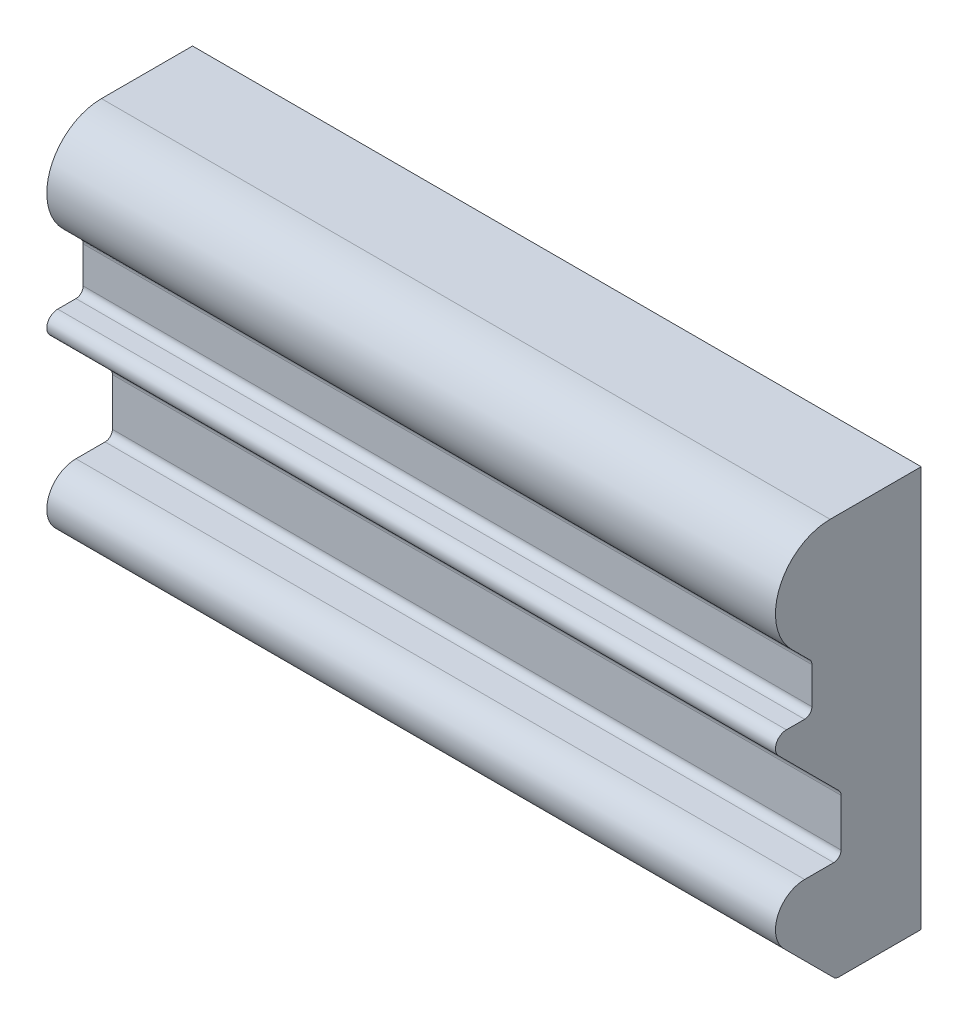
ISO-10303-21;
HEADER;
FILE_DESCRIPTION(('STEP AP214'),'2;1');
FILE_NAME('part.step','',(''),(''),'','','');
FILE_SCHEMA(('AUTOMOTIVE_DESIGN { 1 0 10303 214 1 1 1 1 }'));
ENDSEC;
DATA;
#1=APPLICATION_CONTEXT('core data for automotive mechanical design processes');
#2=APPLICATION_PROTOCOL_DEFINITION('international standard','automotive_design',2000,#1);
#3=PRODUCT_CONTEXT('',#1,'mechanical');
#4=PRODUCT('Part','Part','',(#3));
#5=PRODUCT_RELATED_PRODUCT_CATEGORY('part','',(#4));
#6=PRODUCT_DEFINITION_FORMATION('','',#4);
#7=PRODUCT_DEFINITION_CONTEXT('part definition',#1,'design');
#8=PRODUCT_DEFINITION('design','',#6,#7);
#9=PRODUCT_DEFINITION_SHAPE('','',#8);
#10=(LENGTH_UNIT() NAMED_UNIT(*) SI_UNIT(.MILLI.,.METRE.));
#11=(NAMED_UNIT(*) PLANE_ANGLE_UNIT() SI_UNIT($,.RADIAN.));
#12=(NAMED_UNIT(*) SI_UNIT($,.STERADIAN.) SOLID_ANGLE_UNIT());
#13=UNCERTAINTY_MEASURE_WITH_UNIT(LENGTH_MEASURE(1.E-05),#10,'distance_accuracy_value','');
#14=(GEOMETRIC_REPRESENTATION_CONTEXT(3) GLOBAL_UNCERTAINTY_ASSIGNED_CONTEXT((#13)) GLOBAL_UNIT_ASSIGNED_CONTEXT((#10,
#11,#12)) REPRESENTATION_CONTEXT('',''));
#15=CARTESIAN_POINT('',(0.,0.,0.));
#16=DIRECTION('',(0.,0.,1.));
#17=DIRECTION('',(1.,0.,0.));
#18=AXIS2_PLACEMENT_3D('',#15,#16,#17);
#19=CARTESIAN_POINT('',(200.,67.9583694396574,32.));
#20=DIRECTION('',(-1.,0.,0.));
#21=DIRECTION('',(0.,0.,1.));
#22=AXIS2_PLACEMENT_3D('',#19,#20,#21);
#23=CYLINDRICAL_SURFACE('',#22,2.);
#24=CARTESIAN_POINT('',(0.,67.9583694396574,32.));
#25=DIRECTION('',(-1.,0.,0.));
#26=DIRECTION('',(0.,0.,1.));
#27=AXIS2_PLACEMENT_3D('',#24,#25,#26);
#28=CIRCLE('',#27,2.);
#29=CARTESIAN_POINT('',(0.,67.9583694396574,30.));
#30=VERTEX_POINT('',#29);
#31=CARTESIAN_POINT('',(0.,65.9583694396574,32.));
#32=VERTEX_POINT('',#31);
#33=EDGE_CURVE('E189',#30,#32,#28,.T.);
#34=ORIENTED_EDGE('',*,*,#33,.T.);
#35=DIRECTION('',(-1.,0.,0.));
#36=VECTOR('',#35,1.);
#37=CARTESIAN_POINT('',(200.,65.9583694396574,32.));
#38=LINE('',#37,#36);
#39=CARTESIAN_POINT('',(200.,65.9583694396574,32.));
#40=VERTEX_POINT('',#39);
#41=EDGE_CURVE('E11',#40,#32,#38,.T.);
#42=ORIENTED_EDGE('',*,*,#41,.F.);
#43=CARTESIAN_POINT('',(200.,67.9583694396574,32.));
#44=DIRECTION('',(-1.,0.,0.));
#45=DIRECTION('',(0.,0.,1.));
#46=AXIS2_PLACEMENT_3D('',#43,#44,#45);
#47=CIRCLE('',#46,2.);
#48=CARTESIAN_POINT('',(200.,67.9583694396574,30.));
#49=VERTEX_POINT('',#48);
#50=EDGE_CURVE('E223',#49,#40,#47,.T.);
#51=ORIENTED_EDGE('',*,*,#50,.F.);
#52=DIRECTION('',(-1.,0.,0.));
#53=VECTOR('',#52,1.);
#54=CARTESIAN_POINT('',(200.,67.9583694396574,30.));
#55=LINE('',#54,#53);
#56=EDGE_CURVE('E185',#49,#30,#55,.T.);
#57=ORIENTED_EDGE('',*,*,#56,.T.);
#58=EDGE_LOOP('',(#34,#42,#51,#57));
#59=FACE_BOUND('',#58,.T.);
#60=ADVANCED_FACE('F33',(#59),#23,.F.);
#61=CARTESIAN_POINT('',(200.,65.9583694396574,37.));
#62=DIRECTION('',(0.,-1.,0.));
#63=DIRECTION('',(0.,0.,-1.));
#64=AXIS2_PLACEMENT_3D('',#61,#62,#63);
#65=PLANE('',#64);
#66=DIRECTION('',(0.,0.,1.));
#67=VECTOR('',#66,1.);
#68=CARTESIAN_POINT('',(0.,65.9583694396574,37.));
#69=LINE('',#68,#67);
#70=CARTESIAN_POINT('',(0.,65.9583694396574,37.));
#71=VERTEX_POINT('',#70);
#72=EDGE_CURVE('E192',#32,#71,#69,.T.);
#73=ORIENTED_EDGE('',*,*,#72,.T.);
#74=DIRECTION('',(-1.,0.,0.));
#75=VECTOR('',#74,1.);
#76=CARTESIAN_POINT('',(200.,65.9583694396574,37.));
#77=LINE('',#76,#75);
#78=CARTESIAN_POINT('',(200.,65.9583694396574,37.));
#79=VERTEX_POINT('',#78);
#80=EDGE_CURVE('E41',#79,#71,#77,.T.);
#81=ORIENTED_EDGE('',*,*,#80,.F.);
#82=DIRECTION('',(0.,0.,1.));
#83=VECTOR('',#82,1.);
#84=CARTESIAN_POINT('',(200.,65.9583694396574,37.));
#85=LINE('',#84,#83);
#86=EDGE_CURVE('E122',#40,#79,#85,.T.);
#87=ORIENTED_EDGE('',*,*,#86,.F.);
#88=ORIENTED_EDGE('',*,*,#41,.T.);
#89=EDGE_LOOP('',(#73,#81,#87,#88));
#90=FACE_BOUND('',#89,.T.);
#91=ADVANCED_FACE('F331',(#90),#65,.F.);
#92=CARTESIAN_POINT('',(200.,62.9583694396574,37.));
#93=DIRECTION('',(-1.,0.,0.));
#94=DIRECTION('',(0.,0.,1.));
#95=AXIS2_PLACEMENT_3D('',#92,#93,#94);
#96=CYLINDRICAL_SURFACE('',#95,3.);
#97=CARTESIAN_POINT('',(0.,62.9583694396574,37.));
#98=DIRECTION('',(1.,0.,0.));
#99=DIRECTION('',(0.,0.,-1.));
#100=AXIS2_PLACEMENT_3D('',#97,#98,#99);
#101=CIRCLE('',#100,3.);
#102=CARTESIAN_POINT('',(0.,60.8370490960978,39.1213203435597));
#103=VERTEX_POINT('',#102);
#104=EDGE_CURVE('E194',#71,#103,#101,.T.);
#105=ORIENTED_EDGE('',*,*,#104,.T.);
#106=DIRECTION('',(-1.,0.,0.));
#107=VECTOR('',#106,1.);
#108=CARTESIAN_POINT('',(200.,60.8370490960978,39.1213203435597));
#109=LINE('',#108,#107);
#110=CARTESIAN_POINT('',(200.,60.8370490960978,39.1213203435597));
#111=VERTEX_POINT('',#110);
#112=EDGE_CURVE('E260',#111,#103,#109,.T.);
#113=ORIENTED_EDGE('',*,*,#112,.F.);
#114=CARTESIAN_POINT('',(200.,62.9583694396574,37.));
#115=DIRECTION('',(1.,0.,0.));
#116=DIRECTION('',(0.,0.,-1.));
#117=AXIS2_PLACEMENT_3D('',#114,#115,#116);
#118=CIRCLE('',#117,3.);
#119=EDGE_CURVE('E268',#79,#111,#118,.T.);
#120=ORIENTED_EDGE('',*,*,#119,.F.);
#121=ORIENTED_EDGE('',*,*,#80,.T.);
#122=EDGE_LOOP('',(#105,#113,#120,#121));
#123=FACE_BOUND('',#122,.T.);
#124=ADVANCED_FACE('F266',(#123),#96,.T.);
#125=CARTESIAN_POINT('',(200.,60.8370490960978,39.1213203435597));
#126=DIRECTION('',(0.,0.707106781186544,-0.707106781186551));
#127=DIRECTION('',(0.,0.707106781186551,0.707106781186544));
#128=AXIS2_PLACEMENT_3D('',#125,#126,#127);
#129=PLANE('',#128);
#130=DIRECTION('',(0.,-0.707106781186551,-0.707106781186544));
#131=VECTOR('',#130,1.);
#132=CARTESIAN_POINT('',(0.,60.8370490960978,39.1213203435597));
#133=LINE('',#132,#131);
#134=CARTESIAN_POINT('',(0.,44.3015151901646,22.5857864376266));
#135=VERTEX_POINT('',#134);
#136=EDGE_CURVE('E196',#103,#135,#133,.T.);
#137=ORIENTED_EDGE('',*,*,#136,.T.);
#138=DIRECTION('',(-1.,0.,0.));
#139=VECTOR('',#138,1.);
#140=CARTESIAN_POINT('',(200.,44.3015151901646,22.5857864376266));
#141=LINE('',#140,#139);
#142=CARTESIAN_POINT('',(200.,44.3015151901646,22.5857864376266));
#143=VERTEX_POINT('',#142);
#144=EDGE_CURVE('E257',#143,#135,#141,.T.);
#145=ORIENTED_EDGE('',*,*,#144,.F.);
#146=DIRECTION('',(0.,-0.707106781186551,-0.707106781186544));
#147=VECTOR('',#146,1.);
#148=CARTESIAN_POINT('',(200.,60.8370490960978,39.1213203435597));
#149=LINE('',#148,#147);
#150=EDGE_CURVE('E286',#111,#143,#149,.T.);
#151=ORIENTED_EDGE('',*,*,#150,.F.);
#152=ORIENTED_EDGE('',*,*,#112,.T.);
#153=EDGE_LOOP('',(#137,#145,#151,#152));
#154=FACE_BOUND('',#153,.T.);
#155=ADVANCED_FACE('F277',(#154),#129,.F.);
#156=CARTESIAN_POINT('',(200.,42.8873016277915,23.9999999999997));
#157=DIRECTION('',(-1.,0.,0.));
#158=DIRECTION('',(0.,0.,1.));
#159=AXIS2_PLACEMENT_3D('',#156,#157,#158);
#160=CYLINDRICAL_SURFACE('',#159,1.99999999999998);
#161=CARTESIAN_POINT('',(0.,42.8873016277915,23.9999999999997));
#162=DIRECTION('',(-1.,0.,0.));
#163=DIRECTION('',(0.,0.,1.));
#164=AXIS2_PLACEMENT_3D('',#161,#162,#163);
#165=CIRCLE('',#164,1.99999999999998);
#166=CARTESIAN_POINT('',(0.,42.8873016277915,21.9999999999997));
#167=VERTEX_POINT('',#166);
#168=EDGE_CURVE('E198',#135,#167,#165,.T.);
#169=ORIENTED_EDGE('',*,*,#168,.T.);
#170=DIRECTION('',(-1.,0.,0.));
#171=VECTOR('',#170,1.);
#172=CARTESIAN_POINT('',(200.,42.8873016277915,21.9999999999997));
#173=LINE('',#172,#171);
#174=CARTESIAN_POINT('',(200.,42.8873016277915,21.9999999999997));
#175=VERTEX_POINT('',#174);
#176=EDGE_CURVE('E254',#175,#167,#173,.T.);
#177=ORIENTED_EDGE('',*,*,#176,.F.);
#178=CARTESIAN_POINT('',(200.,42.8873016277915,23.9999999999997));
#179=DIRECTION('',(-1.,0.,0.));
#180=DIRECTION('',(0.,0.,1.));
#181=AXIS2_PLACEMENT_3D('',#178,#179,#180);
#182=CIRCLE('',#181,1.99999999999998);
#183=EDGE_CURVE('E283',#143,#175,#182,.T.);
#184=ORIENTED_EDGE('',*,*,#183,.F.);
#185=ORIENTED_EDGE('',*,*,#144,.T.);
#186=EDGE_LOOP('',(#169,#177,#184,#185));
#187=FACE_BOUND('',#186,.T.);
#188=ADVANCED_FACE('F281',(#187),#160,.F.);
#189=CARTESIAN_POINT('',(200.,29.8873016277915,21.9999999999997));
#190=DIRECTION('',(0.,0.,-1.));
#191=DIRECTION('',(0.,1.,0.));
#192=AXIS2_PLACEMENT_3D('',#189,#190,#191);
#193=PLANE('',#192);
#194=DIRECTION('',(0.,-1.,0.));
#195=VECTOR('',#194,1.);
#196=CARTESIAN_POINT('',(0.,29.8873016277915,21.9999999999997));
#197=LINE('',#196,#195);
#198=CARTESIAN_POINT('',(0.,29.8873016277915,21.9999999999997));
#199=VERTEX_POINT('',#198);
#200=EDGE_CURVE('E200',#167,#199,#197,.T.);
#201=ORIENTED_EDGE('',*,*,#200,.T.);
#202=DIRECTION('',(-1.,0.,0.));
#203=VECTOR('',#202,1.);
#204=CARTESIAN_POINT('',(200.,29.8873016277915,21.9999999999997));
#205=LINE('',#204,#203);
#206=CARTESIAN_POINT('',(200.,29.8873016277915,21.9999999999997));
#207=VERTEX_POINT('',#206);
#208=EDGE_CURVE('E251',#207,#199,#205,.T.);
#209=ORIENTED_EDGE('',*,*,#208,.F.);
#210=DIRECTION('',(0.,-1.,0.));
#211=VECTOR('',#210,1.);
#212=CARTESIAN_POINT('',(200.,29.8873016277915,21.9999999999997));
#213=LINE('',#212,#211);
#214=EDGE_CURVE('E285',#175,#207,#213,.T.);
#215=ORIENTED_EDGE('',*,*,#214,.F.);
#216=ORIENTED_EDGE('',*,*,#176,.T.);
#217=EDGE_LOOP('',(#201,#209,#215,#216));
#218=FACE_BOUND('',#217,.T.);
#219=ADVANCED_FACE('F344',(#218),#193,.F.);
#220=CARTESIAN_POINT('',(200.,29.8873016277915,23.9999999999997));
#221=DIRECTION('',(-1.,0.,0.));
#222=DIRECTION('',(0.,0.,1.));
#223=AXIS2_PLACEMENT_3D('',#220,#221,#222);
#224=CYLINDRICAL_SURFACE('',#223,2.);
#225=CARTESIAN_POINT('',(0.,29.8873016277915,23.9999999999997));
#226=DIRECTION('',(-1.,0.,0.));
#227=DIRECTION('',(0.,0.,1.));
#228=AXIS2_PLACEMENT_3D('',#225,#226,#227);
#229=CIRCLE('',#228,2.);
#230=CARTESIAN_POINT('',(0.,27.8873016277915,23.9999999999997));
#231=VERTEX_POINT('',#230);
#232=EDGE_CURVE('E202',#199,#231,#229,.T.);
#233=ORIENTED_EDGE('',*,*,#232,.T.);
#234=DIRECTION('',(-1.,0.,0.));
#235=VECTOR('',#234,1.);
#236=CARTESIAN_POINT('',(200.,27.8873016277915,23.9999999999997));
#237=LINE('',#236,#235);
#238=CARTESIAN_POINT('',(200.,27.8873016277915,23.9999999999997));
#239=VERTEX_POINT('',#238);
#240=EDGE_CURVE('E248',#239,#231,#237,.T.);
#241=ORIENTED_EDGE('',*,*,#240,.F.);
#242=CARTESIAN_POINT('',(200.,29.8873016277915,23.9999999999997));
#243=DIRECTION('',(-1.,0.,0.));
#244=DIRECTION('',(0.,0.,1.));
#245=AXIS2_PLACEMENT_3D('',#242,#243,#244);
#246=CIRCLE('',#245,2.);
#247=EDGE_CURVE('E288',#207,#239,#246,.T.);
#248=ORIENTED_EDGE('',*,*,#247,.F.);
#249=ORIENTED_EDGE('',*,*,#208,.T.);
#250=EDGE_LOOP('',(#233,#241,#248,#249));
#251=FACE_BOUND('',#250,.T.);
#252=ADVANCED_FACE('F347',(#251),#224,.F.);
#253=CARTESIAN_POINT('',(200.,27.8873016277915,32.));
#254=DIRECTION('',(0.,-1.,0.));
#255=DIRECTION('',(0.,0.,-1.));
#256=AXIS2_PLACEMENT_3D('',#253,#254,#255);
#257=PLANE('',#256);
#258=DIRECTION('',(0.,0.,1.));
#259=VECTOR('',#258,1.);
#260=CARTESIAN_POINT('',(0.,27.8873016277915,32.));
#261=LINE('',#260,#259);
#262=CARTESIAN_POINT('',(0.,27.8873016277915,32.));
#263=VERTEX_POINT('',#262);
#264=EDGE_CURVE('E204',#231,#263,#261,.T.);
#265=ORIENTED_EDGE('',*,*,#264,.T.);
#266=DIRECTION('',(-1.,0.,0.));
#267=VECTOR('',#266,1.);
#268=CARTESIAN_POINT('',(200.,27.8873016277915,32.));
#269=LINE('',#268,#267);
#270=CARTESIAN_POINT('',(200.,27.8873016277915,32.));
#271=VERTEX_POINT('',#270);
#272=EDGE_CURVE('E245',#271,#263,#269,.T.);
#273=ORIENTED_EDGE('',*,*,#272,.F.);
#274=DIRECTION('',(0.,0.,1.));
#275=VECTOR('',#274,1.);
#276=CARTESIAN_POINT('',(200.,27.8873016277915,32.));
#277=LINE('',#276,#275);
#278=EDGE_CURVE('E294',#239,#271,#277,.T.);
#279=ORIENTED_EDGE('',*,*,#278,.F.);
#280=ORIENTED_EDGE('',*,*,#240,.T.);
#281=EDGE_LOOP('',(#265,#273,#279,#280));
#282=FACE_BOUND('',#281,.T.);
#283=ADVANCED_FACE('F351',(#282),#257,.F.);
#284=CARTESIAN_POINT('',(200.,19.8873016277915,32.));
#285=DIRECTION('',(-1.,0.,0.));
#286=DIRECTION('',(0.,0.,1.));
#287=AXIS2_PLACEMENT_3D('',#284,#285,#286);
#288=CYLINDRICAL_SURFACE('',#287,8.);
#289=CARTESIAN_POINT('',(0.,19.8873016277915,32.));
#290=DIRECTION('',(1.,0.,0.));
#291=DIRECTION('',(0.,0.,-1.));
#292=AXIS2_PLACEMENT_3D('',#289,#290,#291);
#293=CIRCLE('',#292,8.);
#294=CARTESIAN_POINT('',(0.,14.2304473782989,37.6568542494922));
#295=VERTEX_POINT('',#294);
#296=EDGE_CURVE('E206',#263,#295,#293,.T.);
#297=ORIENTED_EDGE('',*,*,#296,.T.);
#298=DIRECTION('',(-1.,0.,0.));
#299=VECTOR('',#298,1.);
#300=CARTESIAN_POINT('',(200.,14.2304473782989,37.6568542494922));
#301=LINE('',#300,#299);
#302=CARTESIAN_POINT('',(200.,14.2304473782989,37.6568542494922));
#303=VERTEX_POINT('',#302);
#304=EDGE_CURVE('E242',#303,#295,#301,.T.);
#305=ORIENTED_EDGE('',*,*,#304,.F.);
#306=CARTESIAN_POINT('',(200.,19.8873016277915,32.));
#307=DIRECTION('',(1.,0.,0.));
#308=DIRECTION('',(0.,0.,-1.));
#309=AXIS2_PLACEMENT_3D('',#306,#307,#308);
#310=CIRCLE('',#309,8.);
#311=EDGE_CURVE('E296',#271,#303,#310,.T.);
#312=ORIENTED_EDGE('',*,*,#311,.F.);
#313=ORIENTED_EDGE('',*,*,#272,.T.);
#314=EDGE_LOOP('',(#297,#305,#312,#313));
#315=FACE_BOUND('',#314,.T.);
#316=ADVANCED_FACE('F355',(#315),#288,.T.);
#317=CARTESIAN_POINT('',(200.,14.2304473782989,37.6568542494922));
#318=DIRECTION('',(0.,0.707106781186568,-0.707106781186527));
#319=DIRECTION('',(0.,0.707106781186527,0.707106781186568));
#320=AXIS2_PLACEMENT_3D('',#317,#318,#319);
#321=PLANE('',#320);
#322=DIRECTION('',(0.,-0.707106781186527,-0.707106781186568));
#323=VECTOR('',#322,1.);
#324=CARTESIAN_POINT('',(0.,14.2304473782989,37.6568542494922));
#325=LINE('',#324,#323);
#326=CARTESIAN_POINT('',(0.,0.585786437626861,24.0121933088193));
#327=VERTEX_POINT('',#326);
#328=EDGE_CURVE('E208',#295,#327,#325,.T.);
#329=ORIENTED_EDGE('',*,*,#328,.T.);
#330=DIRECTION('',(-1.,0.,0.));
#331=VECTOR('',#330,1.);
#332=CARTESIAN_POINT('',(200.,0.585786437626861,24.0121933088193));
#333=LINE('',#332,#331);
#334=CARTESIAN_POINT('',(200.,0.585786437626861,24.0121933088193));
#335=VERTEX_POINT('',#334);
#336=EDGE_CURVE('E239',#335,#327,#333,.T.);
#337=ORIENTED_EDGE('',*,*,#336,.F.);
#338=DIRECTION('',(0.,-0.707106781186527,-0.707106781186568));
#339=VECTOR('',#338,1.);
#340=CARTESIAN_POINT('',(200.,14.2304473782989,37.6568542494922));
#341=LINE('',#340,#339);
#342=EDGE_CURVE('E298',#303,#335,#341,.T.);
#343=ORIENTED_EDGE('',*,*,#342,.F.);
#344=ORIENTED_EDGE('',*,*,#304,.T.);
#345=EDGE_LOOP('',(#329,#337,#343,#344));
#346=FACE_BOUND('',#345,.T.);
#347=ADVANCED_FACE('F359',(#346),#321,.F.);
#348=CARTESIAN_POINT('',(200.,2.,22.5979797464463));
#349=DIRECTION('',(-1.,0.,0.));
#350=DIRECTION('',(0.,0.,1.));
#351=AXIS2_PLACEMENT_3D('',#348,#349,#350);
#352=CYLINDRICAL_SURFACE('',#351,2.);
#353=CARTESIAN_POINT('',(0.,2.,22.5979797464463));
#354=DIRECTION('',(1.,0.,0.));
#355=DIRECTION('',(0.,0.,1.));
#356=AXIS2_PLACEMENT_3D('',#353,#354,#355);
#357=CIRCLE('',#356,2.);
#358=CARTESIAN_POINT('',(0.,0.,22.5979797464463));
#359=VERTEX_POINT('',#358);
#360=EDGE_CURVE('E210',#327,#359,#357,.T.);
#361=ORIENTED_EDGE('',*,*,#360,.T.);
#362=DIRECTION('',(-1.,0.,0.));
#363=VECTOR('',#362,1.);
#364=CARTESIAN_POINT('',(200.,0.,22.5979797464463));
#365=LINE('',#364,#363);
#366=CARTESIAN_POINT('',(200.,0.,22.5979797464463));
#367=VERTEX_POINT('',#366);
#368=EDGE_CURVE('E236',#367,#359,#365,.T.);
#369=ORIENTED_EDGE('',*,*,#368,.F.);
#370=CARTESIAN_POINT('',(200.,2.,22.5979797464463));
#371=DIRECTION('',(1.,0.,0.));
#372=DIRECTION('',(0.,0.,1.));
#373=AXIS2_PLACEMENT_3D('',#370,#371,#372);
#374=CIRCLE('',#373,2.);
#375=EDGE_CURVE('E300',#335,#367,#374,.T.);
#376=ORIENTED_EDGE('',*,*,#375,.F.);
#377=ORIENTED_EDGE('',*,*,#336,.T.);
#378=EDGE_LOOP('',(#361,#369,#376,#377));
#379=FACE_BOUND('',#378,.T.);
#380=ADVANCED_FACE('F363',(#379),#352,.T.);
#381=CARTESIAN_POINT('',(200.,0.,0.));
#382=DIRECTION('',(0.,1.,0.));
#383=DIRECTION('',(0.,0.,1.));
#384=AXIS2_PLACEMENT_3D('',#381,#382,#383);
#385=PLANE('',#384);
#386=DIRECTION('',(0.,0.,-1.));
#387=VECTOR('',#386,1.);
#388=CARTESIAN_POINT('',(0.,0.,0.));
#389=LINE('',#388,#387);
#390=CARTESIAN_POINT('',(0.,0.,0.));
#391=VERTEX_POINT('',#390);
#392=EDGE_CURVE('E212',#359,#391,#389,.T.);
#393=ORIENTED_EDGE('',*,*,#392,.T.);
#394=DIRECTION('',(-1.,0.,0.));
#395=VECTOR('',#394,1.);
#396=CARTESIAN_POINT('',(200.,0.,0.));
#397=LINE('',#396,#395);
#398=CARTESIAN_POINT('',(200.,0.,0.));
#399=VERTEX_POINT('',#398);
#400=EDGE_CURVE('E233',#399,#391,#397,.T.);
#401=ORIENTED_EDGE('',*,*,#400,.F.);
#402=DIRECTION('',(0.,0.,-1.));
#403=VECTOR('',#402,1.);
#404=CARTESIAN_POINT('',(200.,0.,0.));
#405=LINE('',#404,#403);
#406=EDGE_CURVE('E302',#367,#399,#405,.T.);
#407=ORIENTED_EDGE('',*,*,#406,.F.);
#408=ORIENTED_EDGE('',*,*,#368,.T.);
#409=EDGE_LOOP('',(#393,#401,#407,#408));
#410=FACE_BOUND('',#409,.T.);
#411=ADVANCED_FACE('F367',(#410),#385,.F.);
#412=CARTESIAN_POINT('',(200.,0.,0.));
#413=DIRECTION('',(0.,0.,1.));
#414=DIRECTION('',(0.,-1.,0.));
#415=AXIS2_PLACEMENT_3D('',#412,#413,#414);
#416=PLANE('',#415);
#417=DIRECTION('',(0.,1.,0.));
#418=VECTOR('',#417,1.);
#419=CARTESIAN_POINT('',(0.,0.,0.));
#420=LINE('',#419,#418);
#421=CARTESIAN_POINT('',(0.,110.,0.));
#422=VERTEX_POINT('',#421);
#423=EDGE_CURVE('E214',#391,#422,#420,.T.);
#424=ORIENTED_EDGE('',*,*,#423,.T.);
#425=DIRECTION('',(-1.,0.,0.));
#426=VECTOR('',#425,1.);
#427=CARTESIAN_POINT('',(200.,110.,0.));
#428=LINE('',#427,#426);
#429=CARTESIAN_POINT('',(200.,110.,0.));
#430=VERTEX_POINT('',#429);
#431=EDGE_CURVE('E230',#430,#422,#428,.T.);
#432=ORIENTED_EDGE('',*,*,#431,.F.);
#433=DIRECTION('',(0.,1.,0.));
#434=VECTOR('',#433,1.);
#435=CARTESIAN_POINT('',(200.,0.,0.));
#436=LINE('',#435,#434);
#437=EDGE_CURVE('E304',#399,#430,#436,.T.);
#438=ORIENTED_EDGE('',*,*,#437,.F.);
#439=ORIENTED_EDGE('',*,*,#400,.T.);
#440=EDGE_LOOP('',(#424,#432,#438,#439));
#441=FACE_BOUND('',#440,.T.);
#442=ADVANCED_FACE('F371',(#441),#416,.F.);
#443=CARTESIAN_POINT('',(200.,110.,0.));
#444=DIRECTION('',(0.,-1.,0.));
#445=DIRECTION('',(0.,0.,-1.));
#446=AXIS2_PLACEMENT_3D('',#443,#444,#445);
#447=PLANE('',#446);
#448=DIRECTION('',(0.,0.,1.));
#449=VECTOR('',#448,1.);
#450=CARTESIAN_POINT('',(0.,110.,0.));
#451=LINE('',#450,#449);
#452=CARTESIAN_POINT('',(0.,110.,25.));
#453=VERTEX_POINT('',#452);
#454=EDGE_CURVE('E216',#422,#453,#451,.T.);
#455=ORIENTED_EDGE('',*,*,#454,.T.);
#456=DIRECTION('',(-1.,0.,0.));
#457=VECTOR('',#456,1.);
#458=CARTESIAN_POINT('',(200.,110.,25.));
#459=LINE('',#458,#457);
#460=CARTESIAN_POINT('',(200.,110.,25.));
#461=VERTEX_POINT('',#460);
#462=EDGE_CURVE('E227',#461,#453,#459,.T.);
#463=ORIENTED_EDGE('',*,*,#462,.F.);
#464=DIRECTION('',(0.,0.,1.));
#465=VECTOR('',#464,1.);
#466=CARTESIAN_POINT('',(200.,110.,0.));
#467=LINE('',#466,#465);
#468=EDGE_CURVE('E306',#430,#461,#467,.T.);
#469=ORIENTED_EDGE('',*,*,#468,.F.);
#470=ORIENTED_EDGE('',*,*,#431,.T.);
#471=EDGE_LOOP('',(#455,#463,#469,#470));
#472=FACE_BOUND('',#471,.T.);
#473=ADVANCED_FACE('F312',(#472),#447,.F.);
#474=CARTESIAN_POINT('',(200.,95.,25.));
#475=DIRECTION('',(-1.,0.,0.));
#476=DIRECTION('',(0.,0.,1.));
#477=AXIS2_PLACEMENT_3D('',#474,#475,#476);
#478=CYLINDRICAL_SURFACE('',#477,15.);
#479=CARTESIAN_POINT('',(0.,95.,25.));
#480=DIRECTION('',(1.,0.,0.));
#481=DIRECTION('',(0.,0.,-1.));
#482=AXIS2_PLACEMENT_3D('',#479,#480,#481);
#483=CIRCLE('',#482,15.);
#484=CARTESIAN_POINT('',(0.,84.3933982822017,35.6066017177982));
#485=VERTEX_POINT('',#484);
#486=EDGE_CURVE('E218',#453,#485,#483,.T.);
#487=ORIENTED_EDGE('',*,*,#486,.T.);
#488=DIRECTION('',(-1.,0.,0.));
#489=VECTOR('',#488,1.);
#490=CARTESIAN_POINT('',(200.,84.3933982822017,35.6066017177982));
#491=LINE('',#490,#489);
#492=CARTESIAN_POINT('',(200.,84.3933982822017,35.6066017177982));
#493=VERTEX_POINT('',#492);
#494=EDGE_CURVE('E180',#493,#485,#491,.T.);
#495=ORIENTED_EDGE('',*,*,#494,.F.);
#496=CARTESIAN_POINT('',(200.,95.,25.));
#497=DIRECTION('',(1.,0.,0.));
#498=DIRECTION('',(0.,0.,-1.));
#499=AXIS2_PLACEMENT_3D('',#496,#497,#498);
#500=CIRCLE('',#499,15.);
#501=EDGE_CURVE('E171',#461,#493,#500,.T.);
#502=ORIENTED_EDGE('',*,*,#501,.F.);
#503=ORIENTED_EDGE('',*,*,#462,.T.);
#504=EDGE_LOOP('',(#487,#495,#502,#503));
#505=FACE_BOUND('',#504,.T.);
#506=ADVANCED_FACE('F316',(#505),#478,.T.);
#507=CARTESIAN_POINT('',(200.,84.3933982822017,35.6066017177982));
#508=DIRECTION('',(0.,0.707106781186549,-0.707106781186546));
#509=DIRECTION('',(0.,0.707106781186546,0.707106781186549));
#510=AXIS2_PLACEMENT_3D('',#507,#508,#509);
#511=PLANE('',#510);
#512=DIRECTION('',(0.,-0.707106781186546,-0.707106781186549));
#513=VECTOR('',#512,1.);
#514=CARTESIAN_POINT('',(0.,84.3933982822017,35.6066017177982));
#515=LINE('',#514,#513);
#516=CARTESIAN_POINT('',(0.,79.3725830020305,30.5857864376269));
#517=VERTEX_POINT('',#516);
#518=EDGE_CURVE('E179',#485,#517,#515,.T.);
#519=ORIENTED_EDGE('',*,*,#518,.T.);
#520=DIRECTION('',(-1.,0.,0.));
#521=VECTOR('',#520,1.);
#522=CARTESIAN_POINT('',(200.,79.3725830020305,30.5857864376269));
#523=LINE('',#522,#521);
#524=CARTESIAN_POINT('',(200.,79.3725830020305,30.5857864376269));
#525=VERTEX_POINT('',#524);
#526=EDGE_CURVE('E176',#525,#517,#523,.T.);
#527=ORIENTED_EDGE('',*,*,#526,.F.);
#528=DIRECTION('',(0.,-0.707106781186546,-0.707106781186549));
#529=VECTOR('',#528,1.);
#530=CARTESIAN_POINT('',(200.,84.3933982822017,35.6066017177982));
#531=LINE('',#530,#529);
#532=EDGE_CURVE('E165',#493,#525,#531,.T.);
#533=ORIENTED_EDGE('',*,*,#532,.F.);
#534=ORIENTED_EDGE('',*,*,#494,.T.);
#535=EDGE_LOOP('',(#519,#527,#533,#534));
#536=FACE_BOUND('',#535,.T.);
#537=ADVANCED_FACE('F177',(#536),#511,.F.);
#538=CARTESIAN_POINT('',(200.,77.9583694396574,32.));
#539=DIRECTION('',(-1.,0.,0.));
#540=DIRECTION('',(0.,0.,1.));
#541=AXIS2_PLACEMENT_3D('',#538,#539,#540);
#542=CYLINDRICAL_SURFACE('',#541,1.99999999999999);
#543=CARTESIAN_POINT('',(0.,77.9583694396574,32.));
#544=DIRECTION('',(-1.,0.,0.));
#545=DIRECTION('',(0.,0.,1.));
#546=AXIS2_PLACEMENT_3D('',#543,#544,#545);
#547=CIRCLE('',#546,1.99999999999999);
#548=CARTESIAN_POINT('',(0.,77.9583694396574,30.));
#549=VERTEX_POINT('',#548);
#550=EDGE_CURVE('E108',#517,#549,#547,.T.);
#551=ORIENTED_EDGE('',*,*,#550,.T.);
#552=DIRECTION('',(-1.,0.,0.));
#553=VECTOR('',#552,1.);
#554=CARTESIAN_POINT('',(200.,77.9583694396574,30.));
#555=LINE('',#554,#553);
#556=CARTESIAN_POINT('',(200.,77.9583694396574,30.));
#557=VERTEX_POINT('',#556);
#558=EDGE_CURVE('E181',#557,#549,#555,.T.);
#559=ORIENTED_EDGE('',*,*,#558,.F.);
#560=CARTESIAN_POINT('',(200.,77.9583694396574,32.));
#561=DIRECTION('',(-1.,0.,0.));
#562=DIRECTION('',(0.,0.,1.));
#563=AXIS2_PLACEMENT_3D('',#560,#561,#562);
#564=CIRCLE('',#563,1.99999999999999);
#565=EDGE_CURVE('E169',#525,#557,#564,.T.);
#566=ORIENTED_EDGE('',*,*,#565,.F.);
#567=ORIENTED_EDGE('',*,*,#526,.T.);
#568=EDGE_LOOP('',(#551,#559,#566,#567));
#569=FACE_BOUND('',#568,.T.);
#570=ADVANCED_FACE('F183',(#569),#542,.F.);
#571=CARTESIAN_POINT('',(200.,77.9583694396574,30.));
#572=DIRECTION('',(0.,0.,-1.));
#573=DIRECTION('',(0.,1.,0.));
#574=AXIS2_PLACEMENT_3D('',#571,#572,#573);
#575=PLANE('',#574);
#576=DIRECTION('',(0.,-1.,0.));
#577=VECTOR('',#576,1.);
#578=CARTESIAN_POINT('',(0.,77.9583694396574,30.));
#579=LINE('',#578,#577);
#580=EDGE_CURVE('E114',#549,#30,#579,.T.);
#581=ORIENTED_EDGE('',*,*,#580,.T.);
#582=ORIENTED_EDGE('',*,*,#56,.F.);
#583=DIRECTION('',(0.,-1.,0.));
#584=VECTOR('',#583,1.);
#585=CARTESIAN_POINT('',(200.,77.9583694396574,30.));
#586=LINE('',#585,#584);
#587=EDGE_CURVE('E49',#557,#49,#586,.T.);
#588=ORIENTED_EDGE('',*,*,#587,.F.);
#589=ORIENTED_EDGE('',*,*,#558,.T.);
#590=EDGE_LOOP('',(#581,#582,#588,#589));
#591=FACE_BOUND('',#590,.T.);
#592=ADVANCED_FACE('F320',(#591),#575,.F.);
#593=CARTESIAN_POINT('',(200.,67.9583694396574,32.));
#594=DIRECTION('',(-1.,0.,0.));
#595=DIRECTION('',(0.,0.,1.));
#596=AXIS2_PLACEMENT_3D('',#593,#594,#595);
#597=PLANE('',#596);
#598=ORIENTED_EDGE('',*,*,#50,.T.);
#599=ORIENTED_EDGE('',*,*,#86,.T.);
#600=ORIENTED_EDGE('',*,*,#119,.T.);
#601=ORIENTED_EDGE('',*,*,#150,.T.);
#602=ORIENTED_EDGE('',*,*,#183,.T.);
#603=ORIENTED_EDGE('',*,*,#214,.T.);
#604=ORIENTED_EDGE('',*,*,#247,.T.);
#605=ORIENTED_EDGE('',*,*,#278,.T.);
#606=ORIENTED_EDGE('',*,*,#311,.T.);
#607=ORIENTED_EDGE('',*,*,#342,.T.);
#608=ORIENTED_EDGE('',*,*,#375,.T.);
#609=ORIENTED_EDGE('',*,*,#406,.T.);
#610=ORIENTED_EDGE('',*,*,#437,.T.);
#611=ORIENTED_EDGE('',*,*,#468,.T.);
#612=ORIENTED_EDGE('',*,*,#501,.T.);
#613=ORIENTED_EDGE('',*,*,#532,.T.);
#614=ORIENTED_EDGE('',*,*,#565,.T.);
#615=ORIENTED_EDGE('',*,*,#587,.T.);
#616=EDGE_LOOP('',(#598,#599,#600,#601,#602,#603,#604,#605,#606,#607,#608,#609,#610,#611,#612,
#613,#614,#615));
#617=FACE_BOUND('',#616,.T.);
#618=ADVANCED_FACE('F167',(#617),#597,.F.);
#619=CARTESIAN_POINT('',(0.,67.9583694396574,32.));
#620=DIRECTION('',(-1.,0.,0.));
#621=DIRECTION('',(0.,0.,1.));
#622=AXIS2_PLACEMENT_3D('',#619,#620,#621);
#623=PLANE('',#622);
#624=ORIENTED_EDGE('',*,*,#33,.F.);
#625=ORIENTED_EDGE('',*,*,#580,.F.);
#626=ORIENTED_EDGE('',*,*,#550,.F.);
#627=ORIENTED_EDGE('',*,*,#518,.F.);
#628=ORIENTED_EDGE('',*,*,#486,.F.);
#629=ORIENTED_EDGE('',*,*,#454,.F.);
#630=ORIENTED_EDGE('',*,*,#423,.F.);
#631=ORIENTED_EDGE('',*,*,#392,.F.);
#632=ORIENTED_EDGE('',*,*,#360,.F.);
#633=ORIENTED_EDGE('',*,*,#328,.F.);
#634=ORIENTED_EDGE('',*,*,#296,.F.);
#635=ORIENTED_EDGE('',*,*,#264,.F.);
#636=ORIENTED_EDGE('',*,*,#232,.F.);
#637=ORIENTED_EDGE('',*,*,#200,.F.);
#638=ORIENTED_EDGE('',*,*,#168,.F.);
#639=ORIENTED_EDGE('',*,*,#136,.F.);
#640=ORIENTED_EDGE('',*,*,#104,.F.);
#641=ORIENTED_EDGE('',*,*,#72,.F.);
#642=EDGE_LOOP('',(#624,#625,#626,#627,#628,#629,#630,#631,#632,#633,#634,#635,#636,#637,#638,
#639,#640,#641));
#643=FACE_BOUND('',#642,.T.);
#644=ADVANCED_FACE('F272',(#643),#623,.T.);
#645=CLOSED_SHELL('',(#60,#91,#124,#155,#188,#219,#252,#283,#316,#347,#380,#411,#442,#473,#506,
#537,#570,#592,#618,#644));
#646=MANIFOLD_SOLID_BREP('B2',#645);
#647=ADVANCED_BREP_SHAPE_REPRESENTATION('',(#18,#646),#14);
#648=SHAPE_DEFINITION_REPRESENTATION(#9,#647);
ENDSEC;
END-ISO-10303-21;
